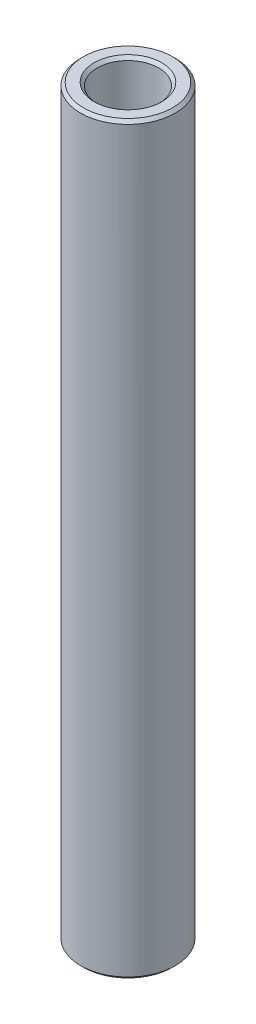
ISO-10303-21;
HEADER;
FILE_DESCRIPTION(('STEP AP214'),'2;1');
FILE_NAME('part.step','',(''),(''),'','','');
FILE_SCHEMA(('AUTOMOTIVE_DESIGN { 1 0 10303 214 1 1 1 1 }'));
ENDSEC;
DATA;
#1=APPLICATION_CONTEXT('core data for automotive mechanical design processes');
#2=APPLICATION_PROTOCOL_DEFINITION('international standard','automotive_design',2000,#1);
#3=PRODUCT_CONTEXT('',#1,'mechanical');
#4=PRODUCT('Part','Part','',(#3));
#5=PRODUCT_RELATED_PRODUCT_CATEGORY('part','',(#4));
#6=PRODUCT_DEFINITION_FORMATION('','',#4);
#7=PRODUCT_DEFINITION_CONTEXT('part definition',#1,'design');
#8=PRODUCT_DEFINITION('design','',#6,#7);
#9=PRODUCT_DEFINITION_SHAPE('','',#8);
#10=(LENGTH_UNIT() NAMED_UNIT(*) SI_UNIT(.MILLI.,.METRE.));
#11=(NAMED_UNIT(*) PLANE_ANGLE_UNIT() SI_UNIT($,.RADIAN.));
#12=(NAMED_UNIT(*) SI_UNIT($,.STERADIAN.) SOLID_ANGLE_UNIT());
#13=UNCERTAINTY_MEASURE_WITH_UNIT(LENGTH_MEASURE(1.E-05),#10,'distance_accuracy_value','');
#14=(GEOMETRIC_REPRESENTATION_CONTEXT(3) GLOBAL_UNCERTAINTY_ASSIGNED_CONTEXT((#13)) GLOBAL_UNIT_ASSIGNED_CONTEXT((#10,
#11,#12)) REPRESENTATION_CONTEXT('',''));
#15=CARTESIAN_POINT('',(0.,0.,0.));
#16=DIRECTION('',(0.,0.,1.));
#17=DIRECTION('',(1.,0.,0.));
#18=AXIS2_PLACEMENT_3D('',#15,#16,#17);
#19=CARTESIAN_POINT('',(0.,9.6155583234771,0.));
#20=DIRECTION('',(0.,1.,0.));
#21=DIRECTION('',(0.,0.,1.));
#22=AXIS2_PLACEMENT_3D('',#19,#20,#21);
#23=CYLINDRICAL_SURFACE('',#22,1.3);
#24=CARTESIAN_POINT('',(0.,-15.56639,0.));
#25=DIRECTION('',(0.,1.,0.));
#26=DIRECTION('',(0.,0.,1.));
#27=AXIS2_PLACEMENT_3D('',#24,#25,#26);
#28=CIRCLE('',#27,1.3);
#29=CARTESIAN_POINT('',(0.,-15.56639,1.3));
#30=VERTEX_POINT('',#29);
#31=EDGE_CURVE('E50',#30,#30,#28,.F.);
#32=ORIENTED_EDGE('',*,*,#31,.T.);
#33=EDGE_LOOP('',(#32));
#34=FACE_BOUND('',#33,.T.);
#35=CARTESIAN_POINT('',(0.,15.56639,0.));
#36=DIRECTION('',(0.,-1.,0.));
#37=DIRECTION('',(0.,0.,-1.));
#38=AXIS2_PLACEMENT_3D('',#35,#36,#37);
#39=CIRCLE('',#38,1.3);
#40=CARTESIAN_POINT('',(0.,15.56639,-1.3));
#41=VERTEX_POINT('',#40);
#42=EDGE_CURVE('E53',#41,#41,#39,.F.);
#43=ORIENTED_EDGE('',*,*,#42,.T.);
#44=EDGE_LOOP('',(#43));
#45=FACE_BOUND('',#44,.T.);
#46=ADVANCED_FACE('F30',(#34,#45),#23,.F.);
#47=CARTESIAN_POINT('',(1.3,-15.69339,0.));
#48=DIRECTION('',(0.,1.,0.));
#49=DIRECTION('',(0.,0.,1.));
#50=AXIS2_PLACEMENT_3D('',#47,#48,#49);
#51=PLANE('',#50);
#52=CARTESIAN_POINT('',(0.,-15.69339,0.));
#53=DIRECTION('',(0.,1.,0.));
#54=DIRECTION('',(0.,0.,1.));
#55=AXIS2_PLACEMENT_3D('',#52,#53,#54);
#56=CIRCLE('',#55,1.427);
#57=CARTESIAN_POINT('',(0.,-15.69339,1.427));
#58=VERTEX_POINT('',#57);
#59=EDGE_CURVE('E56',#58,#58,#56,.T.);
#60=ORIENTED_EDGE('',*,*,#59,.T.);
#61=EDGE_LOOP('',(#60));
#62=FACE_BOUND('',#61,.T.);
#63=CARTESIAN_POINT('',(0.,-15.69339,0.));
#64=DIRECTION('',(0.,1.,0.));
#65=DIRECTION('',(0.,0.,1.));
#66=AXIS2_PLACEMENT_3D('',#63,#64,#65);
#67=CIRCLE('',#66,1.87300000000001);
#68=CARTESIAN_POINT('',(0.,-15.69339,1.87300000000001));
#69=VERTEX_POINT('',#68);
#70=EDGE_CURVE('E59',#69,#69,#67,.F.);
#71=ORIENTED_EDGE('',*,*,#70,.T.);
#72=EDGE_LOOP('',(#71));
#73=FACE_BOUND('',#72,.T.);
#74=ADVANCED_FACE('F63',(#62,#73),#51,.F.);
#75=CARTESIAN_POINT('',(0.,9.6155583234771,0.));
#76=DIRECTION('',(0.,1.,0.));
#77=DIRECTION('',(0.,0.,1.));
#78=AXIS2_PLACEMENT_3D('',#75,#76,#77);
#79=CYLINDRICAL_SURFACE('',#78,2.);
#80=CARTESIAN_POINT('',(0.,-15.56639,0.));
#81=DIRECTION('',(0.,1.,0.));
#82=DIRECTION('',(0.,0.,1.));
#83=AXIS2_PLACEMENT_3D('',#80,#81,#82);
#84=CIRCLE('',#83,2.);
#85=CARTESIAN_POINT('',(0.,-15.56639,2.));
#86=VERTEX_POINT('',#85);
#87=EDGE_CURVE('E41',#86,#86,#84,.T.);
#88=ORIENTED_EDGE('',*,*,#87,.T.);
#89=EDGE_LOOP('',(#88));
#90=FACE_BOUND('',#89,.T.);
#91=CARTESIAN_POINT('',(0.,15.56639,0.));
#92=DIRECTION('',(0.,-1.,0.));
#93=DIRECTION('',(0.,0.,-1.));
#94=AXIS2_PLACEMENT_3D('',#91,#92,#93);
#95=CIRCLE('',#94,2.);
#96=CARTESIAN_POINT('',(0.,15.56639,-2.));
#97=VERTEX_POINT('',#96);
#98=EDGE_CURVE('E45',#97,#97,#95,.T.);
#99=ORIENTED_EDGE('',*,*,#98,.T.);
#100=EDGE_LOOP('',(#99));
#101=FACE_BOUND('',#100,.T.);
#102=ADVANCED_FACE('F73',(#90,#101),#79,.T.);
#103=CARTESIAN_POINT('',(2.,15.69339,0.));
#104=DIRECTION('',(0.,-1.,0.));
#105=DIRECTION('',(0.,0.,-1.));
#106=AXIS2_PLACEMENT_3D('',#103,#104,#105);
#107=PLANE('',#106);
#108=CARTESIAN_POINT('',(0.,15.69339,0.));
#109=DIRECTION('',(0.,-1.,0.));
#110=DIRECTION('',(0.,0.,-1.));
#111=AXIS2_PLACEMENT_3D('',#108,#109,#110);
#112=CIRCLE('',#111,1.873);
#113=CARTESIAN_POINT('',(0.,15.69339,-1.873));
#114=VERTEX_POINT('',#113);
#115=EDGE_CURVE('E10',#114,#114,#112,.F.);
#116=ORIENTED_EDGE('',*,*,#115,.T.);
#117=EDGE_LOOP('',(#116));
#118=FACE_BOUND('',#117,.T.);
#119=CARTESIAN_POINT('',(0.,15.69339,0.));
#120=DIRECTION('',(0.,-1.,0.));
#121=DIRECTION('',(0.,0.,-1.));
#122=AXIS2_PLACEMENT_3D('',#119,#120,#121);
#123=CIRCLE('',#122,1.427);
#124=CARTESIAN_POINT('',(0.,15.69339,-1.427));
#125=VERTEX_POINT('',#124);
#126=EDGE_CURVE('E37',#125,#125,#123,.T.);
#127=ORIENTED_EDGE('',*,*,#126,.T.);
#128=EDGE_LOOP('',(#127));
#129=FACE_BOUND('',#128,.T.);
#130=ADVANCED_FACE('F76',(#118,#129),#107,.F.);
#131=CARTESIAN_POINT('',(0.,-15.69339,0.));
#132=DIRECTION('',(0.,-1.,0.));
#133=DIRECTION('',(0.,0.,-1.));
#134=AXIS2_PLACEMENT_3D('',#131,#132,#133);
#135=CONICAL_SURFACE('',#134,1.427,0.785398163397453);
#136=ORIENTED_EDGE('',*,*,#31,.F.);
#137=EDGE_LOOP('',(#136));
#138=FACE_BOUND('',#137,.T.);
#139=ORIENTED_EDGE('',*,*,#59,.F.);
#140=EDGE_LOOP('',(#139));
#141=FACE_BOUND('',#140,.T.);
#142=ADVANCED_FACE('F69',(#138,#141),#135,.F.);
#143=CARTESIAN_POINT('',(0.,-15.56639,0.));
#144=DIRECTION('',(0.,1.,0.));
#145=DIRECTION('',(0.,0.,1.));
#146=AXIS2_PLACEMENT_3D('',#143,#144,#145);
#147=CONICAL_SURFACE('',#146,2.,0.785398163397459);
#148=ORIENTED_EDGE('',*,*,#70,.F.);
#149=EDGE_LOOP('',(#148));
#150=FACE_BOUND('',#149,.T.);
#151=ORIENTED_EDGE('',*,*,#87,.F.);
#152=EDGE_LOOP('',(#151));
#153=FACE_BOUND('',#152,.T.);
#154=ADVANCED_FACE('F65',(#150,#153),#147,.T.);
#155=CARTESIAN_POINT('',(0.,15.69339,0.));
#156=DIRECTION('',(0.,-1.,0.));
#157=DIRECTION('',(0.,0.,-1.));
#158=AXIS2_PLACEMENT_3D('',#155,#156,#157);
#159=CONICAL_SURFACE('',#158,1.873,0.785398163397465);
#160=ORIENTED_EDGE('',*,*,#98,.F.);
#161=EDGE_LOOP('',(#160));
#162=FACE_BOUND('',#161,.T.);
#163=ORIENTED_EDGE('',*,*,#115,.F.);
#164=EDGE_LOOP('',(#163));
#165=FACE_BOUND('',#164,.T.);
#166=ADVANCED_FACE('F68',(#162,#165),#159,.T.);
#167=CARTESIAN_POINT('',(0.,15.56639,0.));
#168=DIRECTION('',(0.,1.,0.));
#169=DIRECTION('',(0.,0.,1.));
#170=AXIS2_PLACEMENT_3D('',#167,#168,#169);
#171=CONICAL_SURFACE('',#170,1.3,0.785398163397453);
#172=ORIENTED_EDGE('',*,*,#126,.F.);
#173=EDGE_LOOP('',(#172));
#174=FACE_BOUND('',#173,.T.);
#175=ORIENTED_EDGE('',*,*,#42,.F.);
#176=EDGE_LOOP('',(#175));
#177=FACE_BOUND('',#176,.T.);
#178=ADVANCED_FACE('F32',(#174,#177),#171,.F.);
#179=CLOSED_SHELL('',(#46,#74,#102,#130,#142,#154,#166,#178));
#180=MANIFOLD_SOLID_BREP('B2',#179);
#181=ADVANCED_BREP_SHAPE_REPRESENTATION('',(#18,#180),#14);
#182=SHAPE_DEFINITION_REPRESENTATION(#9,#181);
ENDSEC;
END-ISO-10303-21;
